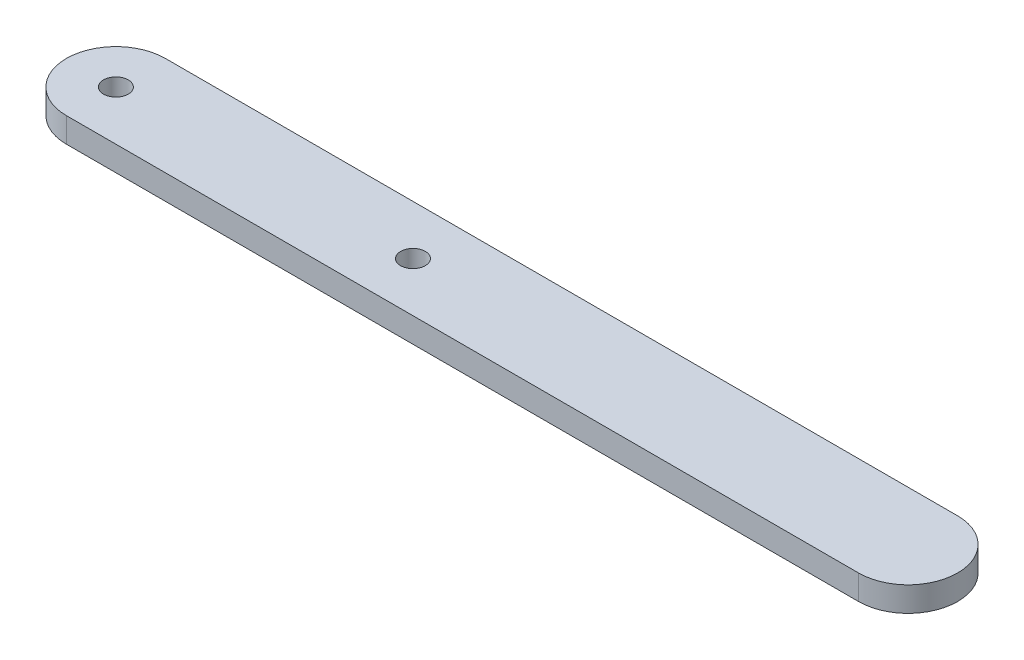
ISO-10303-21;
HEADER;
FILE_DESCRIPTION(('STEP AP214'),'2;1');
FILE_NAME('part.step','',(''),(''),'','','');
FILE_SCHEMA(('AUTOMOTIVE_DESIGN { 1 0 10303 214 1 1 1 1 }'));
ENDSEC;
DATA;
#1=APPLICATION_CONTEXT('core data for automotive mechanical design processes');
#2=APPLICATION_PROTOCOL_DEFINITION('international standard','automotive_design',2000,#1);
#3=PRODUCT_CONTEXT('',#1,'mechanical');
#4=PRODUCT('Part','Part','',(#3));
#5=PRODUCT_RELATED_PRODUCT_CATEGORY('part','',(#4));
#6=PRODUCT_DEFINITION_FORMATION('','',#4);
#7=PRODUCT_DEFINITION_CONTEXT('part definition',#1,'design');
#8=PRODUCT_DEFINITION('design','',#6,#7);
#9=PRODUCT_DEFINITION_SHAPE('','',#8);
#10=(LENGTH_UNIT() NAMED_UNIT(*) SI_UNIT(.MILLI.,.METRE.));
#11=(NAMED_UNIT(*) PLANE_ANGLE_UNIT() SI_UNIT($,.RADIAN.));
#12=(NAMED_UNIT(*) SI_UNIT($,.STERADIAN.) SOLID_ANGLE_UNIT());
#13=UNCERTAINTY_MEASURE_WITH_UNIT(LENGTH_MEASURE(1.E-05),#10,'distance_accuracy_value','');
#14=(GEOMETRIC_REPRESENTATION_CONTEXT(3) GLOBAL_UNCERTAINTY_ASSIGNED_CONTEXT((#13)) GLOBAL_UNIT_ASSIGNED_CONTEXT((#10,
#11,#12)) REPRESENTATION_CONTEXT('',''));
#15=CARTESIAN_POINT('',(0.,0.,0.));
#16=DIRECTION('',(0.,0.,1.));
#17=DIRECTION('',(1.,0.,0.));
#18=AXIS2_PLACEMENT_3D('',#15,#16,#17);
#19=CARTESIAN_POINT('',(0.,3.175,0.));
#20=DIRECTION('',(0.,1.,0.));
#21=DIRECTION('',(0.,0.,1.));
#22=AXIS2_PLACEMENT_3D('',#19,#20,#21);
#23=PLANE('',#22);
#24=CARTESIAN_POINT('',(0.,3.175,0.));
#25=DIRECTION('',(0.,1.,0.));
#26=DIRECTION('',(0.,0.,1.));
#27=AXIS2_PLACEMENT_3D('',#24,#25,#26);
#28=CIRCLE('',#27,1.5875);
#29=CARTESIAN_POINT('',(0.,3.175,1.58749999999999));
#30=VERTEX_POINT('',#29);
#31=EDGE_CURVE('E100',#30,#30,#28,.T.);
#32=ORIENTED_EDGE('',*,*,#31,.F.);
#33=EDGE_LOOP('',(#32));
#34=FACE_BOUND('',#33,.T.);
#35=CARTESIAN_POINT('',(0.,3.175,0.));
#36=DIRECTION('',(0.,1.,0.));
#37=DIRECTION('',(0.,0.,1.));
#38=AXIS2_PLACEMENT_3D('',#35,#36,#37);
#39=CIRCLE('',#38,6.35);
#40=CARTESIAN_POINT('',(0.,3.175,-6.35000000000001));
#41=VERTEX_POINT('',#40);
#42=CARTESIAN_POINT('',(0.,3.175,6.35));
#43=VERTEX_POINT('',#42);
#44=EDGE_CURVE('E85',#41,#43,#39,.T.);
#45=ORIENTED_EDGE('',*,*,#44,.T.);
#46=DIRECTION('',(1.,0.,0.));
#47=VECTOR('',#46,1.);
#48=CARTESIAN_POINT('',(0.,3.175,6.35));
#49=LINE('',#48,#47);
#50=CARTESIAN_POINT('',(101.6,3.175,6.35));
#51=VERTEX_POINT('',#50);
#52=EDGE_CURVE('E80',#43,#51,#49,.T.);
#53=ORIENTED_EDGE('',*,*,#52,.T.);
#54=CARTESIAN_POINT('',(101.6,3.175,0.));
#55=DIRECTION('',(0.,1.,0.));
#56=DIRECTION('',(0.,0.,1.));
#57=AXIS2_PLACEMENT_3D('',#54,#55,#56);
#58=CIRCLE('',#57,6.35);
#59=CARTESIAN_POINT('',(101.6,3.175,-6.35000000000001));
#60=VERTEX_POINT('',#59);
#61=EDGE_CURVE('E83',#51,#60,#58,.T.);
#62=ORIENTED_EDGE('',*,*,#61,.T.);
#63=DIRECTION('',(-1.,0.,0.));
#64=VECTOR('',#63,1.);
#65=CARTESIAN_POINT('',(0.,3.175,-6.35000000000001));
#66=LINE('',#65,#64);
#67=EDGE_CURVE('E50',#60,#41,#66,.T.);
#68=ORIENTED_EDGE('',*,*,#67,.T.);
#69=EDGE_LOOP('',(#45,#53,#62,#68));
#70=FACE_BOUND('',#69,.T.);
#71=CARTESIAN_POINT('',(38.1,3.175,0.));
#72=DIRECTION('',(0.,1.,0.));
#73=DIRECTION('',(0.,0.,1.));
#74=AXIS2_PLACEMENT_3D('',#71,#72,#73);
#75=CIRCLE('',#74,1.5875);
#76=CARTESIAN_POINT('',(38.1,3.175,1.5875));
#77=VERTEX_POINT('',#76);
#78=EDGE_CURVE('E115',#77,#77,#75,.T.);
#79=ORIENTED_EDGE('',*,*,#78,.F.);
#80=EDGE_LOOP('',(#79));
#81=FACE_BOUND('',#80,.T.);
#82=ADVANCED_FACE('F33',(#34,#70,#81),#23,.T.);
#83=CARTESIAN_POINT('',(0.,0.,0.));
#84=DIRECTION('',(0.,1.,0.));
#85=DIRECTION('',(0.,0.,1.));
#86=AXIS2_PLACEMENT_3D('',#83,#84,#85);
#87=PLANE('',#86);
#88=CARTESIAN_POINT('',(0.,0.,0.));
#89=DIRECTION('',(0.,1.,0.));
#90=DIRECTION('',(0.,0.,1.));
#91=AXIS2_PLACEMENT_3D('',#88,#89,#90);
#92=CIRCLE('',#91,6.35);
#93=CARTESIAN_POINT('',(0.,0.,-6.35000000000001));
#94=VERTEX_POINT('',#93);
#95=CARTESIAN_POINT('',(0.,0.,6.35));
#96=VERTEX_POINT('',#95);
#97=EDGE_CURVE('E97',#94,#96,#92,.T.);
#98=ORIENTED_EDGE('',*,*,#97,.F.);
#99=DIRECTION('',(-1.,0.,0.));
#100=VECTOR('',#99,1.);
#101=CARTESIAN_POINT('',(0.,0.,-6.35000000000001));
#102=LINE('',#101,#100);
#103=CARTESIAN_POINT('',(101.6,0.,-6.35000000000001));
#104=VERTEX_POINT('',#103);
#105=EDGE_CURVE('E73',#104,#94,#102,.T.);
#106=ORIENTED_EDGE('',*,*,#105,.F.);
#107=CARTESIAN_POINT('',(101.6,0.,0.));
#108=DIRECTION('',(0.,1.,0.));
#109=DIRECTION('',(0.,0.,1.));
#110=AXIS2_PLACEMENT_3D('',#107,#108,#109);
#111=CIRCLE('',#110,6.35);
#112=CARTESIAN_POINT('',(101.6,0.,6.35));
#113=VERTEX_POINT('',#112);
#114=EDGE_CURVE('E67',#113,#104,#111,.T.);
#115=ORIENTED_EDGE('',*,*,#114,.F.);
#116=DIRECTION('',(1.,0.,0.));
#117=VECTOR('',#116,1.);
#118=CARTESIAN_POINT('',(0.,0.,6.35));
#119=LINE('',#118,#117);
#120=EDGE_CURVE('E89',#96,#113,#119,.T.);
#121=ORIENTED_EDGE('',*,*,#120,.F.);
#122=EDGE_LOOP('',(#98,#106,#115,#121));
#123=FACE_BOUND('',#122,.T.);
#124=CARTESIAN_POINT('',(0.,0.,0.));
#125=DIRECTION('',(0.,1.,0.));
#126=DIRECTION('',(0.,0.,1.));
#127=AXIS2_PLACEMENT_3D('',#124,#125,#126);
#128=CIRCLE('',#127,1.5875);
#129=CARTESIAN_POINT('',(0.,0.,1.58749999999999));
#130=VERTEX_POINT('',#129);
#131=EDGE_CURVE('E112',#130,#130,#128,.T.);
#132=ORIENTED_EDGE('',*,*,#131,.T.);
#133=EDGE_LOOP('',(#132));
#134=FACE_BOUND('',#133,.T.);
#135=CARTESIAN_POINT('',(38.1,0.,0.));
#136=DIRECTION('',(0.,1.,0.));
#137=DIRECTION('',(0.,0.,1.));
#138=AXIS2_PLACEMENT_3D('',#135,#136,#137);
#139=CIRCLE('',#138,1.5875);
#140=CARTESIAN_POINT('',(38.1,0.,1.5875));
#141=VERTEX_POINT('',#140);
#142=EDGE_CURVE('E118',#141,#141,#139,.T.);
#143=ORIENTED_EDGE('',*,*,#142,.T.);
#144=EDGE_LOOP('',(#143));
#145=FACE_BOUND('',#144,.T.);
#146=ADVANCED_FACE('F108',(#123,#134,#145),#87,.F.);
#147=CARTESIAN_POINT('',(0.,3.175,0.));
#148=DIRECTION('',(0.,-1.,0.));
#149=DIRECTION('',(0.,0.,-1.));
#150=AXIS2_PLACEMENT_3D('',#147,#148,#149);
#151=CYLINDRICAL_SURFACE('',#150,6.35);
#152=ORIENTED_EDGE('',*,*,#97,.T.);
#153=DIRECTION('',(0.,-1.,0.));
#154=VECTOR('',#153,1.);
#155=CARTESIAN_POINT('',(0.,3.175,6.35));
#156=LINE('',#155,#154);
#157=EDGE_CURVE('E11',#43,#96,#156,.T.);
#158=ORIENTED_EDGE('',*,*,#157,.F.);
#159=ORIENTED_EDGE('',*,*,#44,.F.);
#160=DIRECTION('',(0.,-1.,0.));
#161=VECTOR('',#160,1.);
#162=CARTESIAN_POINT('',(0.,3.175,-6.35000000000001));
#163=LINE('',#162,#161);
#164=EDGE_CURVE('E93',#41,#94,#163,.T.);
#165=ORIENTED_EDGE('',*,*,#164,.T.);
#166=EDGE_LOOP('',(#152,#158,#159,#165));
#167=FACE_BOUND('',#166,.T.);
#168=ADVANCED_FACE('F35',(#167),#151,.T.);
#169=CARTESIAN_POINT('',(0.,3.175,6.35));
#170=DIRECTION('',(0.,0.,-1.));
#171=DIRECTION('',(-1.,0.,0.));
#172=AXIS2_PLACEMENT_3D('',#169,#170,#171);
#173=PLANE('',#172);
#174=ORIENTED_EDGE('',*,*,#120,.T.);
#175=DIRECTION('',(0.,-1.,0.));
#176=VECTOR('',#175,1.);
#177=CARTESIAN_POINT('',(101.6,3.175,6.35));
#178=LINE('',#177,#176);
#179=EDGE_CURVE('E42',#51,#113,#178,.T.);
#180=ORIENTED_EDGE('',*,*,#179,.F.);
#181=ORIENTED_EDGE('',*,*,#52,.F.);
#182=ORIENTED_EDGE('',*,*,#157,.T.);
#183=EDGE_LOOP('',(#174,#180,#181,#182));
#184=FACE_BOUND('',#183,.T.);
#185=ADVANCED_FACE('F88',(#184),#173,.F.);
#186=CARTESIAN_POINT('',(101.6,3.175,0.));
#187=DIRECTION('',(0.,-1.,0.));
#188=DIRECTION('',(0.,0.,-1.));
#189=AXIS2_PLACEMENT_3D('',#186,#187,#188);
#190=CYLINDRICAL_SURFACE('',#189,6.35);
#191=ORIENTED_EDGE('',*,*,#114,.T.);
#192=DIRECTION('',(0.,-1.,0.));
#193=VECTOR('',#192,1.);
#194=CARTESIAN_POINT('',(101.6,3.175,-6.35000000000001));
#195=LINE('',#194,#193);
#196=EDGE_CURVE('E90',#60,#104,#195,.T.);
#197=ORIENTED_EDGE('',*,*,#196,.F.);
#198=ORIENTED_EDGE('',*,*,#61,.F.);
#199=ORIENTED_EDGE('',*,*,#179,.T.);
#200=EDGE_LOOP('',(#191,#197,#198,#199));
#201=FACE_BOUND('',#200,.T.);
#202=ADVANCED_FACE('F91',(#201),#190,.T.);
#203=CARTESIAN_POINT('',(0.,3.175,-6.35000000000001));
#204=DIRECTION('',(0.,0.,1.));
#205=DIRECTION('',(1.,0.,0.));
#206=AXIS2_PLACEMENT_3D('',#203,#204,#205);
#207=PLANE('',#206);
#208=ORIENTED_EDGE('',*,*,#105,.T.);
#209=ORIENTED_EDGE('',*,*,#164,.F.);
#210=ORIENTED_EDGE('',*,*,#67,.F.);
#211=ORIENTED_EDGE('',*,*,#196,.T.);
#212=EDGE_LOOP('',(#208,#209,#210,#211));
#213=FACE_BOUND('',#212,.T.);
#214=ADVANCED_FACE('F105',(#213),#207,.F.);
#215=CARTESIAN_POINT('',(0.,3.175,0.));
#216=DIRECTION('',(0.,-1.,0.));
#217=DIRECTION('',(0.,0.,-1.));
#218=AXIS2_PLACEMENT_3D('',#215,#216,#217);
#219=CYLINDRICAL_SURFACE('',#218,1.5875);
#220=ORIENTED_EDGE('',*,*,#31,.T.);
#221=EDGE_LOOP('',(#220));
#222=FACE_BOUND('',#221,.T.);
#223=ORIENTED_EDGE('',*,*,#131,.F.);
#224=EDGE_LOOP('',(#223));
#225=FACE_BOUND('',#224,.T.);
#226=ADVANCED_FACE('F135',(#222,#225),#219,.F.);
#227=CARTESIAN_POINT('',(38.1,3.175,0.));
#228=DIRECTION('',(0.,-1.,0.));
#229=DIRECTION('',(0.,0.,-1.));
#230=AXIS2_PLACEMENT_3D('',#227,#228,#229);
#231=CYLINDRICAL_SURFACE('',#230,1.5875);
#232=ORIENTED_EDGE('',*,*,#78,.T.);
#233=EDGE_LOOP('',(#232));
#234=FACE_BOUND('',#233,.T.);
#235=ORIENTED_EDGE('',*,*,#142,.F.);
#236=EDGE_LOOP('',(#235));
#237=FACE_BOUND('',#236,.T.);
#238=ADVANCED_FACE('F124',(#234,#237),#231,.F.);
#239=CLOSED_SHELL('',(#82,#146,#168,#185,#202,#214,#226,#238));
#240=MANIFOLD_SOLID_BREP('B2',#239);
#241=ADVANCED_BREP_SHAPE_REPRESENTATION('',(#18,#240),#14);
#242=SHAPE_DEFINITION_REPRESENTATION(#9,#241);
ENDSEC;
END-ISO-10303-21;
